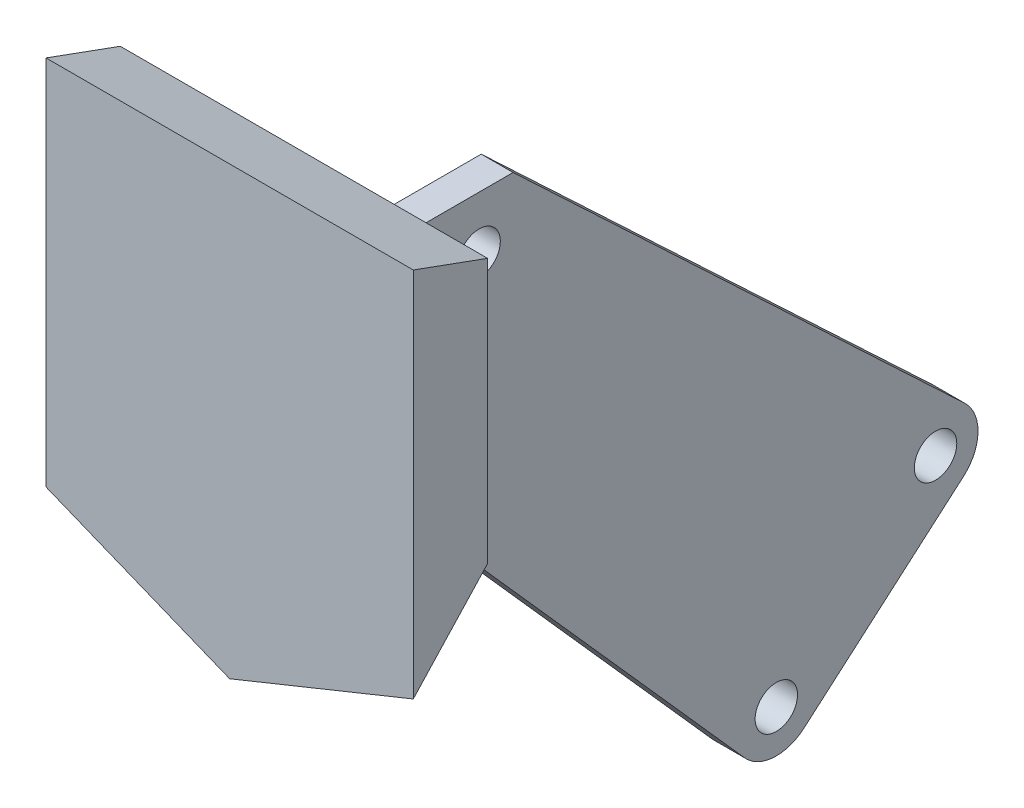
ISO-10303-21;
HEADER;
FILE_DESCRIPTION(('STEP AP214'),'2;1');
FILE_NAME('part.step','',(''),(''),'','','');
FILE_SCHEMA(('AUTOMOTIVE_DESIGN { 1 0 10303 214 1 1 1 1 }'));
ENDSEC;
DATA;
#1=APPLICATION_CONTEXT('core data for automotive mechanical design processes');
#2=APPLICATION_PROTOCOL_DEFINITION('international standard','automotive_design',2000,#1);
#3=PRODUCT_CONTEXT('',#1,'mechanical');
#4=PRODUCT('Part','Part','',(#3));
#5=PRODUCT_RELATED_PRODUCT_CATEGORY('part','',(#4));
#6=PRODUCT_DEFINITION_FORMATION('','',#4);
#7=PRODUCT_DEFINITION_CONTEXT('part definition',#1,'design');
#8=PRODUCT_DEFINITION('design','',#6,#7);
#9=PRODUCT_DEFINITION_SHAPE('','',#8);
#10=(LENGTH_UNIT() NAMED_UNIT(*) SI_UNIT(.MILLI.,.METRE.));
#11=(NAMED_UNIT(*) PLANE_ANGLE_UNIT() SI_UNIT($,.RADIAN.));
#12=(NAMED_UNIT(*) SI_UNIT($,.STERADIAN.) SOLID_ANGLE_UNIT());
#13=UNCERTAINTY_MEASURE_WITH_UNIT(LENGTH_MEASURE(1.E-05),#10,'distance_accuracy_value','');
#14=(GEOMETRIC_REPRESENTATION_CONTEXT(3) GLOBAL_UNCERTAINTY_ASSIGNED_CONTEXT((#13)) GLOBAL_UNIT_ASSIGNED_CONTEXT((#10,
#11,#12)) REPRESENTATION_CONTEXT('',''));
#15=CARTESIAN_POINT('',(0.,0.,0.));
#16=DIRECTION('',(0.,0.,1.));
#17=DIRECTION('',(1.,0.,0.));
#18=AXIS2_PLACEMENT_3D('',#15,#16,#17);
#19=CARTESIAN_POINT('',(0.,0.,-7.));
#20=DIRECTION('',(0.,0.,1.));
#21=DIRECTION('',(1.,0.,0.));
#22=AXIS2_PLACEMENT_3D('',#19,#20,#21);
#23=PLANE('',#22);
#24=DIRECTION('',(0.,-1.,0.));
#25=VECTOR('',#24,1.);
#26=CARTESIAN_POINT('',(8.5,14.9522083601366,-7.));
#27=LINE('',#26,#25);
#28=CARTESIAN_POINT('',(8.5,14.9522083601366,-7.));
#29=VERTEX_POINT('',#28);
#30=CARTESIAN_POINT('',(8.5,0.,-7.));
#31=VERTEX_POINT('',#30);
#32=EDGE_CURVE('E183',#29,#31,#27,.T.);
#33=ORIENTED_EDGE('',*,*,#32,.T.);
#34=DIRECTION('',(1.,0.,0.));
#35=VECTOR('',#34,1.);
#36=CARTESIAN_POINT('',(8.5,0.,-7.));
#37=LINE('',#36,#35);
#38=CARTESIAN_POINT('',(-17.3,0.,-7.));
#39=VERTEX_POINT('',#38);
#40=EDGE_CURVE('E221',#39,#31,#37,.T.);
#41=ORIENTED_EDGE('',*,*,#40,.F.);
#42=DIRECTION('',(0.,-1.,0.));
#43=VECTOR('',#42,1.);
#44=CARTESIAN_POINT('',(-17.3,-17.5,-7.));
#45=LINE('',#44,#43);
#46=CARTESIAN_POINT('',(-17.3,14.9522083601366,-7.));
#47=VERTEX_POINT('',#46);
#48=EDGE_CURVE('E268',#47,#39,#45,.T.);
#49=ORIENTED_EDGE('',*,*,#48,.F.);
#50=DIRECTION('',(1.,0.,0.));
#51=VECTOR('',#50,1.);
#52=CARTESIAN_POINT('',(17.3,14.9522083601366,-7.));
#53=LINE('',#52,#51);
#54=EDGE_CURVE('E298',#47,#29,#53,.T.);
#55=ORIENTED_EDGE('',*,*,#54,.T.);
#56=EDGE_LOOP('',(#33,#41,#49,#55));
#57=FACE_BOUND('',#56,.T.);
#58=ADVANCED_FACE('F33',(#57),#23,.F.);
#59=CARTESIAN_POINT('',(8.5,-12.,-15.2));
#60=DIRECTION('',(1.,0.,0.));
#61=DIRECTION('',(0.,0.,-1.));
#62=AXIS2_PLACEMENT_3D('',#59,#60,#61);
#63=PLANE('',#62);
#64=DIRECTION('',(0.,0.,-1.));
#65=VECTOR('',#64,1.);
#66=CARTESIAN_POINT('',(8.5,-12.,-15.2));
#67=LINE('',#66,#65);
#68=CARTESIAN_POINT('',(8.5,-12.,-7.));
#69=VERTEX_POINT('',#68);
#70=CARTESIAN_POINT('',(8.5,-12.,-8.82366423719207));
#71=VERTEX_POINT('',#70);
#72=EDGE_CURVE('E225',#69,#71,#67,.T.);
#73=ORIENTED_EDGE('',*,*,#72,.T.);
#74=DIRECTION('',(0.,-0.747359492890157,-0.664419888614849));
#75=VECTOR('',#74,1.);
#76=CARTESIAN_POINT('',(8.5,-43.7054711943228,-37.0105620284394));
#77=LINE('',#76,#75);
#78=CARTESIAN_POINT('',(8.5,-9.94868756510111,-7.));
#79=VERTEX_POINT('',#78);
#80=EDGE_CURVE('E353',#79,#71,#77,.T.);
#81=ORIENTED_EDGE('',*,*,#80,.F.);
#82=DIRECTION('',(0.,1.,0.));
#83=VECTOR('',#82,1.);
#84=CARTESIAN_POINT('',(8.5,-12.,-7.));
#85=LINE('',#84,#83);
#86=EDGE_CURVE('E238',#69,#79,#85,.T.);
#87=ORIENTED_EDGE('',*,*,#86,.F.);
#88=EDGE_LOOP('',(#73,#81,#87));
#89=FACE_BOUND('',#88,.T.);
#90=ADVANCED_FACE('F352',(#89),#63,.T.);
#91=DIRECTION('',(-1.,0.,0.));
#92=VECTOR('',#91,1.);
#93=CARTESIAN_POINT('',(11.5,-9.94868756510111,-7.));
#94=LINE('',#93,#92);
#95=CARTESIAN_POINT('',(11.5,-9.94868756510111,-7.));
#96=VERTEX_POINT('',#95);
#97=EDGE_CURVE('E370',#96,#79,#94,.T.);
#98=ORIENTED_EDGE('',*,*,#97,.F.);
#99=DIRECTION('',(0.,-1.,0.));
#100=VECTOR('',#99,1.);
#101=CARTESIAN_POINT('',(11.5,14.9522083601366,-7.));
#102=LINE('',#101,#100);
#103=CARTESIAN_POINT('',(11.5,14.9522083601366,-7.));
#104=VERTEX_POINT('',#103);
#105=EDGE_CURVE('E180',#104,#96,#102,.T.);
#106=ORIENTED_EDGE('',*,*,#105,.F.);
#107=CARTESIAN_POINT('',(17.3,14.9522083601366,-7.));
#108=VERTEX_POINT('',#107);
#109=EDGE_CURVE('E54',#104,#108,#53,.T.);
#110=ORIENTED_EDGE('',*,*,#109,.T.);
#111=DIRECTION('',(0.,1.,0.));
#112=VECTOR('',#111,1.);
#113=CARTESIAN_POINT('',(17.3,17.5,-7.));
#114=LINE('',#113,#112);
#115=CARTESIAN_POINT('',(17.3,-9.94868756510111,-7.));
#116=VERTEX_POINT('',#115);
#117=EDGE_CURVE('E264',#116,#108,#114,.T.);
#118=ORIENTED_EDGE('',*,*,#117,.F.);
#119=DIRECTION('',(-0.926991176745522,-0.375083135099344,0.));
#120=VECTOR('',#119,1.);
#121=CARTESIAN_POINT('',(-2.62558194569542,-18.0110617627813,-7.));
#122=LINE('',#121,#120);
#123=CARTESIAN_POINT('',(0.,-16.9486875651011,-7.));
#124=VERTEX_POINT('',#123);
#125=EDGE_CURVE('E271',#116,#124,#122,.T.);
#126=ORIENTED_EDGE('',*,*,#125,.T.);
#127=DIRECTION('',(-0.926991176745522,0.375083135099344,0.));
#128=VECTOR('',#127,1.);
#129=CARTESIAN_POINT('',(-14.6744180543046,-11.0110617627813,-7.));
#130=LINE('',#129,#128);
#131=CARTESIAN_POINT('',(-12.2303278394641,-12.,-7.));
#132=VERTEX_POINT('',#131);
#133=EDGE_CURVE('E288',#124,#132,#130,.T.);
#134=ORIENTED_EDGE('',*,*,#133,.T.);
#135=DIRECTION('',(1.,0.,0.));
#136=VECTOR('',#135,1.);
#137=CARTESIAN_POINT('',(8.5,-12.,-7.));
#138=LINE('',#137,#136);
#139=EDGE_CURVE('E41',#132,#69,#138,.T.);
#140=ORIENTED_EDGE('',*,*,#139,.T.);
#141=ORIENTED_EDGE('',*,*,#86,.T.);
#142=EDGE_LOOP('',(#98,#106,#110,#118,#126,#134,#140,#141));
#143=FACE_BOUND('',#142,.T.);
#144=ADVANCED_FACE('F304',(#143),#23,.F.);
#145=CARTESIAN_POINT('',(17.3,17.5,-7.));
#146=DIRECTION('',(1.,0.,0.));
#147=DIRECTION('',(0.,0.,-1.));
#148=AXIS2_PLACEMENT_3D('',#145,#146,#147);
#149=PLANE('',#148);
#150=ORIENTED_EDGE('',*,*,#117,.T.);
#151=DIRECTION('',(0.,0.342020143325666,0.93969262078591));
#152=VECTOR('',#151,1.);
#153=CARTESIAN_POINT('',(17.3,15.2502433660971,-6.18115555091643));
#154=LINE('',#153,#152);
#155=CARTESIAN_POINT('',(17.3,17.5,0.));
#156=VERTEX_POINT('',#155);
#157=EDGE_CURVE('E300',#108,#156,#154,.T.);
#158=ORIENTED_EDGE('',*,*,#157,.T.);
#159=DIRECTION('',(0.,1.,0.));
#160=VECTOR('',#159,1.);
#161=CARTESIAN_POINT('',(17.3,17.5,0.));
#162=LINE('',#161,#160);
#163=CARTESIAN_POINT('',(17.3,-17.5,0.));
#164=VERTEX_POINT('',#163);
#165=EDGE_CURVE('E272',#164,#156,#162,.T.);
#166=ORIENTED_EDGE('',*,*,#165,.F.);
#167=DIRECTION('',(0.,0.733371095333155,-0.679828534654032));
#168=VECTOR('',#167,1.);
#169=CARTESIAN_POINT('',(17.3,4.81412690114105,-20.6849987541376));
#170=LINE('',#169,#168);
#171=EDGE_CURVE('E293',#164,#116,#170,.T.);
#172=ORIENTED_EDGE('',*,*,#171,.T.);
#173=EDGE_LOOP('',(#150,#158,#166,#172));
#174=FACE_BOUND('',#173,.T.);
#175=ADVANCED_FACE('F449',(#174),#149,.T.);
#176=CARTESIAN_POINT('',(-17.3,-17.5,-7.));
#177=DIRECTION('',(-1.,0.,0.));
#178=DIRECTION('',(0.,0.,1.));
#179=AXIS2_PLACEMENT_3D('',#176,#177,#178);
#180=PLANE('',#179);
#181=DIRECTION('',(0.,-1.,0.));
#182=VECTOR('',#181,1.);
#183=CARTESIAN_POINT('',(-17.3,-17.5,0.));
#184=LINE('',#183,#182);
#185=CARTESIAN_POINT('',(-17.3,17.5,0.));
#186=VERTEX_POINT('',#185);
#187=CARTESIAN_POINT('',(-17.3,-17.5,0.));
#188=VERTEX_POINT('',#187);
#189=EDGE_CURVE('E278',#186,#188,#184,.T.);
#190=ORIENTED_EDGE('',*,*,#189,.F.);
#191=DIRECTION('',(0.,-0.342020143325666,-0.93969262078591));
#192=VECTOR('',#191,1.);
#193=CARTESIAN_POINT('',(-17.3,11.1560211206793,-17.4299387204308));
#194=LINE('',#193,#192);
#195=EDGE_CURVE('E295',#186,#47,#194,.T.);
#196=ORIENTED_EDGE('',*,*,#195,.T.);
#197=ORIENTED_EDGE('',*,*,#48,.T.);
#198=CARTESIAN_POINT('',(-17.3,-9.9486875651011,-7.));
#199=VERTEX_POINT('',#198);
#200=EDGE_CURVE('E266',#39,#199,#45,.T.);
#201=ORIENTED_EDGE('',*,*,#200,.T.);
#202=DIRECTION('',(0.,-0.733371095333155,0.679828534654032));
#203=VECTOR('',#202,1.);
#204=CARTESIAN_POINT('',(-17.3,-14.0100338203143,-3.23516785570894));
#205=LINE('',#204,#203);
#206=EDGE_CURVE('E291',#199,#188,#205,.T.);
#207=ORIENTED_EDGE('',*,*,#206,.T.);
#208=EDGE_LOOP('',(#190,#196,#197,#201,#207));
#209=FACE_BOUND('',#208,.T.);
#210=ADVANCED_FACE('F322',(#209),#180,.T.);
#211=CARTESIAN_POINT('',(0.,0.,0.));
#212=DIRECTION('',(0.,0.,1.));
#213=DIRECTION('',(1.,0.,0.));
#214=AXIS2_PLACEMENT_3D('',#211,#212,#213);
#215=PLANE('',#214);
#216=ORIENTED_EDGE('',*,*,#165,.T.);
#217=DIRECTION('',(-1.,0.,0.));
#218=VECTOR('',#217,1.);
#219=CARTESIAN_POINT('',(-17.3,17.5,0.));
#220=LINE('',#219,#218);
#221=EDGE_CURVE('E275',#156,#186,#220,.T.);
#222=ORIENTED_EDGE('',*,*,#221,.T.);
#223=ORIENTED_EDGE('',*,*,#189,.T.);
#224=DIRECTION('',(0.926991176745522,-0.375083135099344,0.));
#225=VECTOR('',#224,1.);
#226=CARTESIAN_POINT('',(-17.3,-17.5,0.));
#227=LINE('',#226,#225);
#228=CARTESIAN_POINT('',(0.,-24.5,0.));
#229=VERTEX_POINT('',#228);
#230=EDGE_CURVE('E281',#188,#229,#227,.T.);
#231=ORIENTED_EDGE('',*,*,#230,.T.);
#232=DIRECTION('',(0.926991176745522,0.375083135099344,0.));
#233=VECTOR('',#232,1.);
#234=CARTESIAN_POINT('',(0.,-24.5,0.));
#235=LINE('',#234,#233);
#236=EDGE_CURVE('E267',#229,#164,#235,.T.);
#237=ORIENTED_EDGE('',*,*,#236,.T.);
#238=EDGE_LOOP('',(#216,#222,#223,#231,#237));
#239=FACE_BOUND('',#238,.T.);
#240=ADVANCED_FACE('F324',(#239),#215,.T.);
#241=CARTESIAN_POINT('',(0.,-24.5,0.));
#242=DIRECTION('',(0.265223828337456,-0.655481747176855,-0.707106781186549));
#243=DIRECTION('',(-0.926991176745522,-0.375083135099344,0.));
#244=AXIS2_PLACEMENT_3D('',#241,#242,#243);
#245=PLANE('',#244);
#246=ORIENTED_EDGE('',*,*,#171,.F.);
#247=ORIENTED_EDGE('',*,*,#236,.F.);
#248=DIRECTION('',(0.,0.733371095333155,-0.679828534654032));
#249=VECTOR('',#248,1.);
#250=CARTESIAN_POINT('',(0.,-24.5,0.));
#251=LINE('',#250,#249);
#252=EDGE_CURVE('E255',#124,#229,#251,.F.);
#253=ORIENTED_EDGE('',*,*,#252,.F.);
#254=ORIENTED_EDGE('',*,*,#125,.F.);
#255=EDGE_LOOP('',(#246,#247,#253,#254));
#256=FACE_BOUND('',#255,.T.);
#257=ADVANCED_FACE('F460',(#256),#245,.T.);
#258=CARTESIAN_POINT('',(-17.3,-17.5,0.));
#259=DIRECTION('',(-0.265223828337456,-0.655481747176855,-0.707106781186549));
#260=DIRECTION('',(-0.926991176745522,0.375083135099344,0.));
#261=AXIS2_PLACEMENT_3D('',#258,#259,#260);
#262=PLANE('',#261);
#263=ORIENTED_EDGE('',*,*,#206,.F.);
#264=EDGE_CURVE('E287',#132,#199,#130,.T.);
#265=ORIENTED_EDGE('',*,*,#264,.F.);
#266=ORIENTED_EDGE('',*,*,#133,.F.);
#267=ORIENTED_EDGE('',*,*,#252,.T.);
#268=ORIENTED_EDGE('',*,*,#230,.F.);
#269=EDGE_LOOP('',(#263,#265,#266,#267,#268));
#270=FACE_BOUND('',#269,.T.);
#271=ADVANCED_FACE('F316',(#270),#262,.T.);
#272=CARTESIAN_POINT('',(-17.3,17.5,0.));
#273=DIRECTION('',(0.,0.939692620785909,-0.342020143325666));
#274=DIRECTION('',(1.,0.,0.));
#275=AXIS2_PLACEMENT_3D('',#272,#273,#274);
#276=PLANE('',#275);
#277=ORIENTED_EDGE('',*,*,#157,.F.);
#278=ORIENTED_EDGE('',*,*,#109,.F.);
#279=DIRECTION('',(-1.,0.,0.));
#280=VECTOR('',#279,1.);
#281=CARTESIAN_POINT('',(11.5,14.9522083601366,-7.));
#282=LINE('',#281,#280);
#283=EDGE_CURVE('E372',#104,#29,#282,.T.);
#284=ORIENTED_EDGE('',*,*,#283,.T.);
#285=ORIENTED_EDGE('',*,*,#54,.F.);
#286=ORIENTED_EDGE('',*,*,#195,.F.);
#287=ORIENTED_EDGE('',*,*,#221,.F.);
#288=EDGE_LOOP('',(#277,#278,#284,#285,#286,#287));
#289=FACE_BOUND('',#288,.T.);
#290=ADVANCED_FACE('F35',(#289),#276,.T.);
#291=CARTESIAN_POINT('',(8.5,-12.,-7.));
#292=DIRECTION('',(0.,0.,1.));
#293=DIRECTION('',(1.,0.,0.));
#294=AXIS2_PLACEMENT_3D('',#291,#292,#293);
#295=PLANE('',#294);
#296=CARTESIAN_POINT('',(-17.3,-12.,-7.));
#297=VERTEX_POINT('',#296);
#298=EDGE_CURVE('E222',#297,#132,#138,.T.);
#299=ORIENTED_EDGE('',*,*,#298,.T.);
#300=ORIENTED_EDGE('',*,*,#264,.T.);
#301=DIRECTION('',(0.,1.,0.));
#302=VECTOR('',#301,1.);
#303=CARTESIAN_POINT('',(-17.3,-12.,-7.));
#304=LINE('',#303,#302);
#305=EDGE_CURVE('E252',#297,#199,#304,.T.);
#306=ORIENTED_EDGE('',*,*,#305,.F.);
#307=EDGE_LOOP('',(#299,#300,#306));
#308=FACE_BOUND('',#307,.T.);
#309=ADVANCED_FACE('F313',(#308),#295,.T.);
#310=CARTESIAN_POINT('',(-17.3,-12.,-7.));
#311=DIRECTION('',(-0.707106781186549,0.,0.707106781186546));
#312=DIRECTION('',(0.707106781186546,0.,0.707106781186549));
#313=AXIS2_PLACEMENT_3D('',#310,#311,#312);
#314=PLANE('',#313);
#315=CARTESIAN_POINT('',(-20.,-5.,-9.70000000000001));
#316=DIRECTION('',(-0.707106781186549,0.,0.707106781186546));
#317=DIRECTION('',(-0.707106781186546,0.,-0.707106781186549));
#318=AXIS2_PLACEMENT_3D('',#315,#316,#317);
#319=ELLIPSE('',#318,2.82842712474619,2.);
#320=CARTESIAN_POINT('',(-20.5,-3.06350832689629,-10.2));
#321=VERTEX_POINT('',#320);
#322=CARTESIAN_POINT('',(-20.5,-6.9364916731037,-10.2));
#323=VERTEX_POINT('',#322);
#324=EDGE_CURVE('E217',#321,#323,#319,.T.);
#325=ORIENTED_EDGE('',*,*,#324,.F.);
#326=DIRECTION('',(0.,1.,0.));
#327=VECTOR('',#326,1.);
#328=CARTESIAN_POINT('',(-20.5,-12.,-10.2));
#329=LINE('',#328,#327);
#330=EDGE_CURVE('E11',#323,#321,#329,.T.);
#331=ORIENTED_EDGE('',*,*,#330,.F.);
#332=EDGE_LOOP('',(#325,#331));
#333=FACE_BOUND('',#332,.T.);
#334=DIRECTION('',(0.707106781186546,0.,0.707106781186549));
#335=VECTOR('',#334,1.);
#336=CARTESIAN_POINT('',(-17.3,0.,-7.));
#337=LINE('',#336,#335);
#338=CARTESIAN_POINT('',(-23.5,0.,-13.2));
#339=VERTEX_POINT('',#338);
#340=EDGE_CURVE('E226',#339,#39,#337,.T.);
#341=ORIENTED_EDGE('',*,*,#340,.F.);
#342=DIRECTION('',(0.,1.,0.));
#343=VECTOR('',#342,1.);
#344=CARTESIAN_POINT('',(-23.5,-12.,-13.2));
#345=LINE('',#344,#343);
#346=CARTESIAN_POINT('',(-23.5,-12.,-13.2));
#347=VERTEX_POINT('',#346);
#348=EDGE_CURVE('E256',#347,#339,#345,.T.);
#349=ORIENTED_EDGE('',*,*,#348,.F.);
#350=DIRECTION('',(0.707106781186546,0.,0.707106781186549));
#351=VECTOR('',#350,1.);
#352=CARTESIAN_POINT('',(-17.3,-12.,-7.));
#353=LINE('',#352,#351);
#354=EDGE_CURVE('E235',#347,#297,#353,.T.);
#355=ORIENTED_EDGE('',*,*,#354,.T.);
#356=ORIENTED_EDGE('',*,*,#305,.T.);
#357=ORIENTED_EDGE('',*,*,#200,.F.);
#358=EDGE_LOOP('',(#341,#349,#355,#356,#357));
#359=FACE_BOUND('',#358,.T.);
#360=ADVANCED_FACE('F339',(#333,#359),#314,.T.);
#361=CARTESIAN_POINT('',(-23.5,-12.,-13.2));
#362=DIRECTION('',(-1.,0.,0.));
#363=DIRECTION('',(0.,0.,1.));
#364=AXIS2_PLACEMENT_3D('',#361,#362,#363);
#365=PLANE('',#364);
#366=DIRECTION('',(0.,0.,1.));
#367=VECTOR('',#366,1.);
#368=CARTESIAN_POINT('',(-23.5,0.,-13.2));
#369=LINE('',#368,#367);
#370=CARTESIAN_POINT('',(-23.5,0.,-15.2));
#371=VERTEX_POINT('',#370);
#372=EDGE_CURVE('E247',#371,#339,#369,.T.);
#373=ORIENTED_EDGE('',*,*,#372,.F.);
#374=DIRECTION('',(0.,1.,0.));
#375=VECTOR('',#374,1.);
#376=CARTESIAN_POINT('',(-23.5,-12.,-15.2));
#377=LINE('',#376,#375);
#378=CARTESIAN_POINT('',(-23.5,-12.,-15.2));
#379=VERTEX_POINT('',#378);
#380=EDGE_CURVE('E258',#379,#371,#377,.T.);
#381=ORIENTED_EDGE('',*,*,#380,.F.);
#382=DIRECTION('',(0.,0.,1.));
#383=VECTOR('',#382,1.);
#384=CARTESIAN_POINT('',(-23.5,-12.,-13.2));
#385=LINE('',#384,#383);
#386=EDGE_CURVE('E232',#379,#347,#385,.T.);
#387=ORIENTED_EDGE('',*,*,#386,.T.);
#388=ORIENTED_EDGE('',*,*,#348,.T.);
#389=EDGE_LOOP('',(#373,#381,#387,#388));
#390=FACE_BOUND('',#389,.T.);
#391=ADVANCED_FACE('F501',(#390),#365,.T.);
#392=CARTESIAN_POINT('',(-23.5,-12.,-15.2));
#393=DIRECTION('',(0.,0.,-1.));
#394=DIRECTION('',(-1.,0.,0.));
#395=AXIS2_PLACEMENT_3D('',#392,#393,#394);
#396=PLANE('',#395);
#397=CARTESIAN_POINT('',(5.,-5.,-15.2));
#398=DIRECTION('',(0.,0.,-1.));
#399=DIRECTION('',(-1.,0.,0.));
#400=AXIS2_PLACEMENT_3D('',#397,#398,#399);
#401=CIRCLE('',#400,2.);
#402=CARTESIAN_POINT('',(3.,-5.,-15.2));
#403=VERTEX_POINT('',#402);
#404=EDGE_CURVE('E208',#403,#403,#401,.T.);
#405=ORIENTED_EDGE('',*,*,#404,.F.);
#406=EDGE_LOOP('',(#405));
#407=FACE_BOUND('',#406,.T.);
#408=CARTESIAN_POINT('',(-20.,-5.,-15.2));
#409=DIRECTION('',(0.,0.,-1.));
#410=DIRECTION('',(1.,0.,0.));
#411=AXIS2_PLACEMENT_3D('',#408,#409,#410);
#412=CIRCLE('',#411,2.);
#413=CARTESIAN_POINT('',(-18.,-5.,-15.2));
#414=VERTEX_POINT('',#413);
#415=EDGE_CURVE('E201',#414,#414,#412,.T.);
#416=ORIENTED_EDGE('',*,*,#415,.F.);
#417=EDGE_LOOP('',(#416));
#418=FACE_BOUND('',#417,.T.);
#419=CARTESIAN_POINT('',(-14.5,-7.39791576165636,-15.2));
#420=DIRECTION('',(0.,0.,-1.));
#421=DIRECTION('',(1.,0.,0.));
#422=AXIS2_PLACEMENT_3D('',#419,#420,#421);
#423=CIRCLE('',#422,2.);
#424=CARTESIAN_POINT('',(-12.5,-7.39791576165636,-15.2));
#425=VERTEX_POINT('',#424);
#426=EDGE_CURVE('E192',#425,#425,#423,.T.);
#427=ORIENTED_EDGE('',*,*,#426,.F.);
#428=EDGE_LOOP('',(#427));
#429=FACE_BOUND('',#428,.T.);
#430=CARTESIAN_POINT('',(-0.5,-7.39791576165636,-15.2));
#431=DIRECTION('',(0.,0.,-1.));
#432=DIRECTION('',(-1.,0.,0.));
#433=AXIS2_PLACEMENT_3D('',#430,#431,#432);
#434=CIRCLE('',#433,2.);
#435=CARTESIAN_POINT('',(-2.5,-7.39791576165636,-15.2));
#436=VERTEX_POINT('',#435);
#437=EDGE_CURVE('E207',#436,#436,#434,.T.);
#438=ORIENTED_EDGE('',*,*,#437,.F.);
#439=EDGE_LOOP('',(#438));
#440=FACE_BOUND('',#439,.T.);
#441=DIRECTION('',(-1.,0.,0.));
#442=VECTOR('',#441,1.);
#443=CARTESIAN_POINT('',(-23.5,0.,-15.2));
#444=LINE('',#443,#442);
#445=CARTESIAN_POINT('',(8.5,0.,-15.2));
#446=VERTEX_POINT('',#445);
#447=EDGE_CURVE('E244',#446,#371,#444,.T.);
#448=ORIENTED_EDGE('',*,*,#447,.F.);
#449=DIRECTION('',(0.,1.,0.));
#450=VECTOR('',#449,1.);
#451=CARTESIAN_POINT('',(8.5,-12.,-15.2));
#452=LINE('',#451,#450);
#453=CARTESIAN_POINT('',(8.5,-12.,-15.2));
#454=VERTEX_POINT('',#453);
#455=EDGE_CURVE('E260',#454,#446,#452,.T.);
#456=ORIENTED_EDGE('',*,*,#455,.F.);
#457=DIRECTION('',(-1.,0.,0.));
#458=VECTOR('',#457,1.);
#459=CARTESIAN_POINT('',(-23.5,-12.,-15.2));
#460=LINE('',#459,#458);
#461=EDGE_CURVE('E229',#454,#379,#460,.T.);
#462=ORIENTED_EDGE('',*,*,#461,.T.);
#463=ORIENTED_EDGE('',*,*,#380,.T.);
#464=EDGE_LOOP('',(#448,#456,#462,#463));
#465=FACE_BOUND('',#464,.T.);
#466=ADVANCED_FACE('F346',(#407,#418,#429,#440,#465),#396,.T.);
#467=CARTESIAN_POINT('',(0.,-12.,0.));
#468=DIRECTION('',(0.,-1.,0.));
#469=DIRECTION('',(0.,0.,-1.));
#470=AXIS2_PLACEMENT_3D('',#467,#468,#469);
#471=PLANE('',#470);
#472=ORIENTED_EDGE('',*,*,#298,.F.);
#473=ORIENTED_EDGE('',*,*,#354,.F.);
#474=ORIENTED_EDGE('',*,*,#386,.F.);
#475=ORIENTED_EDGE('',*,*,#461,.F.);
#476=DIRECTION('',(0.,0.,1.));
#477=VECTOR('',#476,1.);
#478=CARTESIAN_POINT('',(8.5,-12.,0.));
#479=LINE('',#478,#477);
#480=EDGE_CURVE('E189',#454,#71,#479,.T.);
#481=ORIENTED_EDGE('',*,*,#480,.T.);
#482=ORIENTED_EDGE('',*,*,#72,.F.);
#483=ORIENTED_EDGE('',*,*,#139,.F.);
#484=EDGE_LOOP('',(#472,#473,#474,#475,#481,#482,#483));
#485=FACE_BOUND('',#484,.T.);
#486=ADVANCED_FACE('F309',(#485),#471,.T.);
#487=CARTESIAN_POINT('',(0.,0.,0.));
#488=DIRECTION('',(0.,-1.,0.));
#489=DIRECTION('',(0.,0.,-1.));
#490=AXIS2_PLACEMENT_3D('',#487,#488,#489);
#491=PLANE('',#490);
#492=ORIENTED_EDGE('',*,*,#40,.T.);
#493=DIRECTION('',(0.,0.,-1.));
#494=VECTOR('',#493,1.);
#495=CARTESIAN_POINT('',(8.5,0.,-15.2));
#496=LINE('',#495,#494);
#497=EDGE_CURVE('E241',#31,#446,#496,.T.);
#498=ORIENTED_EDGE('',*,*,#497,.T.);
#499=ORIENTED_EDGE('',*,*,#447,.T.);
#500=ORIENTED_EDGE('',*,*,#372,.T.);
#501=ORIENTED_EDGE('',*,*,#340,.T.);
#502=EDGE_LOOP('',(#492,#498,#499,#500,#501));
#503=FACE_BOUND('',#502,.T.);
#504=ADVANCED_FACE('F335',(#503),#491,.F.);
#505=CARTESIAN_POINT('',(-0.5,-7.39791576165636,-10.2));
#506=DIRECTION('',(0.,0.,-1.));
#507=DIRECTION('',(-1.,0.,0.));
#508=AXIS2_PLACEMENT_3D('',#505,#506,#507);
#509=CYLINDRICAL_SURFACE('',#508,2.);
#510=CARTESIAN_POINT('',(-0.5,-7.39791576165636,-10.2));
#511=DIRECTION('',(0.,0.,-1.));
#512=DIRECTION('',(-1.,0.,0.));
#513=AXIS2_PLACEMENT_3D('',#510,#511,#512);
#514=CIRCLE('',#513,2.);
#515=CARTESIAN_POINT('',(-2.5,-7.39791576165636,-10.2));
#516=VERTEX_POINT('',#515);
#517=EDGE_CURVE('E214',#516,#516,#514,.T.);
#518=ORIENTED_EDGE('',*,*,#517,.F.);
#519=EDGE_LOOP('',(#518));
#520=FACE_BOUND('',#519,.T.);
#521=ORIENTED_EDGE('',*,*,#437,.T.);
#522=EDGE_LOOP('',(#521));
#523=FACE_BOUND('',#522,.T.);
#524=ADVANCED_FACE('F519',(#520,#523),#509,.F.);
#525=CARTESIAN_POINT('',(-0.5,-7.39791576165636,-10.2));
#526=DIRECTION('',(0.,0.,-1.));
#527=DIRECTION('',(-1.,0.,0.));
#528=AXIS2_PLACEMENT_3D('',#525,#526,#527);
#529=PLANE('',#528);
#530=ORIENTED_EDGE('',*,*,#517,.T.);
#531=EDGE_LOOP('',(#530));
#532=FACE_BOUND('',#531,.T.);
#533=ADVANCED_FACE('F524',(#532),#529,.T.);
#534=CARTESIAN_POINT('',(-14.5,-7.39791576165636,-10.2));
#535=DIRECTION('',(0.,0.,-1.));
#536=DIRECTION('',(-1.,0.,0.));
#537=AXIS2_PLACEMENT_3D('',#534,#535,#536);
#538=CYLINDRICAL_SURFACE('',#537,2.);
#539=CARTESIAN_POINT('',(-14.5,-7.39791576165636,-10.2));
#540=DIRECTION('',(0.,0.,-1.));
#541=DIRECTION('',(1.,0.,0.));
#542=AXIS2_PLACEMENT_3D('',#539,#540,#541);
#543=CIRCLE('',#542,2.);
#544=CARTESIAN_POINT('',(-12.5,-7.39791576165636,-10.2));
#545=VERTEX_POINT('',#544);
#546=EDGE_CURVE('E198',#545,#545,#543,.T.);
#547=ORIENTED_EDGE('',*,*,#546,.F.);
#548=EDGE_LOOP('',(#547));
#549=FACE_BOUND('',#548,.T.);
#550=ORIENTED_EDGE('',*,*,#426,.T.);
#551=EDGE_LOOP('',(#550));
#552=FACE_BOUND('',#551,.T.);
#553=ADVANCED_FACE('F536',(#549,#552),#538,.F.);
#554=CARTESIAN_POINT('',(-14.5,-7.39791576165636,-10.2));
#555=DIRECTION('',(0.,0.,1.));
#556=DIRECTION('',(1.,0.,0.));
#557=AXIS2_PLACEMENT_3D('',#554,#555,#556);
#558=PLANE('',#557);
#559=ORIENTED_EDGE('',*,*,#546,.T.);
#560=EDGE_LOOP('',(#559));
#561=FACE_BOUND('',#560,.T.);
#562=ADVANCED_FACE('F546',(#561),#558,.F.);
#563=CARTESIAN_POINT('',(-20.,-5.,-10.2));
#564=DIRECTION('',(0.,0.,-1.));
#565=DIRECTION('',(-1.,0.,0.));
#566=AXIS2_PLACEMENT_3D('',#563,#564,#565);
#567=CYLINDRICAL_SURFACE('',#566,2.);
#568=ORIENTED_EDGE('',*,*,#324,.T.);
#569=CARTESIAN_POINT('',(-20.,-5.,-10.2));
#570=DIRECTION('',(0.,0.,-1.));
#571=DIRECTION('',(1.,0.,0.));
#572=AXIS2_PLACEMENT_3D('',#569,#570,#571);
#573=CIRCLE('',#572,2.);
#574=EDGE_CURVE('E46',#321,#323,#573,.T.);
#575=ORIENTED_EDGE('',*,*,#574,.F.);
#576=EDGE_LOOP('',(#568,#575));
#577=FACE_BOUND('',#576,.T.);
#578=ORIENTED_EDGE('',*,*,#415,.T.);
#579=EDGE_LOOP('',(#578));
#580=FACE_BOUND('',#579,.T.);
#581=ADVANCED_FACE('F556',(#577,#580),#567,.F.);
#582=CARTESIAN_POINT('',(-20.,-5.,-10.2));
#583=DIRECTION('',(0.,0.,1.));
#584=DIRECTION('',(1.,0.,0.));
#585=AXIS2_PLACEMENT_3D('',#582,#583,#584);
#586=PLANE('',#585);
#587=ORIENTED_EDGE('',*,*,#330,.T.);
#588=ORIENTED_EDGE('',*,*,#574,.T.);
#589=EDGE_LOOP('',(#587,#588));
#590=FACE_BOUND('',#589,.T.);
#591=ADVANCED_FACE('F566',(#590),#586,.F.);
#592=CARTESIAN_POINT('',(5.,-5.,-10.2));
#593=DIRECTION('',(0.,0.,-1.));
#594=DIRECTION('',(-1.,0.,0.));
#595=AXIS2_PLACEMENT_3D('',#592,#593,#594);
#596=CYLINDRICAL_SURFACE('',#595,2.);
#597=CARTESIAN_POINT('',(5.,-5.,-10.2));
#598=DIRECTION('',(0.,0.,-1.));
#599=DIRECTION('',(-1.,0.,0.));
#600=AXIS2_PLACEMENT_3D('',#597,#598,#599);
#601=CIRCLE('',#600,2.);
#602=CARTESIAN_POINT('',(3.,-5.,-10.2));
#603=VERTEX_POINT('',#602);
#604=EDGE_CURVE('E204',#603,#603,#601,.T.);
#605=ORIENTED_EDGE('',*,*,#604,.F.);
#606=EDGE_LOOP('',(#605));
#607=FACE_BOUND('',#606,.T.);
#608=ORIENTED_EDGE('',*,*,#404,.T.);
#609=EDGE_LOOP('',(#608));
#610=FACE_BOUND('',#609,.T.);
#611=ADVANCED_FACE('F435',(#607,#610),#596,.F.);
#612=CARTESIAN_POINT('',(5.,-5.,-10.2));
#613=DIRECTION('',(0.,0.,-1.));
#614=DIRECTION('',(-1.,0.,0.));
#615=AXIS2_PLACEMENT_3D('',#612,#613,#614);
#616=PLANE('',#615);
#617=ORIENTED_EDGE('',*,*,#604,.T.);
#618=EDGE_LOOP('',(#617));
#619=FACE_BOUND('',#618,.T.);
#620=ADVANCED_FACE('F427',(#619),#616,.T.);
#621=CARTESIAN_POINT('',(11.5,-28.0477916398634,-55.));
#622=DIRECTION('',(1.,0.,0.));
#623=DIRECTION('',(0.,0.,-1.));
#624=AXIS2_PLACEMENT_3D('',#621,#622,#623);
#625=PLANE('',#624);
#626=CARTESIAN_POINT('',(11.5,-28.0477916398634,-55.));
#627=DIRECTION('',(1.,0.,0.));
#628=DIRECTION('',(0.,0.,-1.));
#629=AXIS2_PLACEMENT_3D('',#626,#627,#628);
#630=CIRCLE('',#629,2.);
#631=CARTESIAN_POINT('',(11.5,-28.0477916398634,-57.));
#632=VERTEX_POINT('',#631);
#633=EDGE_CURVE('E408',#632,#632,#630,.T.);
#634=ORIENTED_EDGE('',*,*,#633,.F.);
#635=EDGE_LOOP('',(#634));
#636=FACE_BOUND('',#635,.T.);
#637=DIRECTION('',(0.,-0.747359492890157,-0.664419888614849));
#638=VECTOR('',#637,1.);
#639=CARTESIAN_POINT('',(11.5,-43.7054711943228,-37.0105620284394));
#640=LINE('',#639,#638);
#641=CARTESIAN_POINT('',(11.5,-43.7054711943228,-37.0105620284394));
#642=VERTEX_POINT('',#641);
#643=EDGE_CURVE('E175',#96,#642,#640,.T.);
#644=ORIENTED_EDGE('',*,*,#643,.T.);
#645=CARTESIAN_POINT('',(11.5,-41.0477916398634,-40.));
#646=DIRECTION('',(1.,0.,0.));
#647=DIRECTION('',(0.,0.,1.));
#648=AXIS2_PLACEMENT_3D('',#645,#646,#647);
#649=CIRCLE('',#648,4.);
#650=CARTESIAN_POINT('',(11.5,-44.0705479710227,-42.6197221536713));
#651=VERTEX_POINT('',#650);
#652=EDGE_CURVE('E165',#642,#651,#649,.T.);
#653=ORIENTED_EDGE('',*,*,#652,.T.);
#654=DIRECTION('',(0.,0.654930538417843,-0.755689082789817));
#655=VECTOR('',#654,1.);
#656=CARTESIAN_POINT('',(11.5,-31.0705479710227,-57.6197221536713));
#657=LINE('',#656,#655);
#658=CARTESIAN_POINT('',(11.5,-31.0705479710227,-57.6197221536714));
#659=VERTEX_POINT('',#658);
#660=EDGE_CURVE('E174',#651,#659,#657,.T.);
#661=ORIENTED_EDGE('',*,*,#660,.T.);
#662=CARTESIAN_POINT('',(11.5,-28.0477916398634,-55.));
#663=DIRECTION('',(1.,0.,0.));
#664=DIRECTION('',(0.,0.,-1.));
#665=AXIS2_PLACEMENT_3D('',#662,#663,#664);
#666=CIRCLE('',#665,3.99999999999998);
#667=CARTESIAN_POINT('',(11.5,-25.1366376371623,-57.7432065858329));
#668=VERTEX_POINT('',#667);
#669=EDGE_CURVE('E386',#659,#668,#666,.T.);
#670=ORIENTED_EDGE('',*,*,#669,.T.);
#671=DIRECTION('',(0.,0.685801646458227,0.727788500675289));
#672=VECTOR('',#671,1.);
#673=CARTESIAN_POINT('',(11.5,-25.1366376371623,-57.7432065858329));
#674=LINE('',#673,#672);
#675=CARTESIAN_POINT('',(11.5,14.9522083601366,-15.2));
#676=VERTEX_POINT('',#675);
#677=EDGE_CURVE('E400',#668,#676,#674,.T.);
#678=ORIENTED_EDGE('',*,*,#677,.T.);
#679=DIRECTION('',(0.,0.,1.));
#680=VECTOR('',#679,1.);
#681=CARTESIAN_POINT('',(11.5,14.9522083601366,-15.2));
#682=LINE('',#681,#680);
#683=EDGE_CURVE('E399',#676,#104,#682,.T.);
#684=ORIENTED_EDGE('',*,*,#683,.T.);
#685=ORIENTED_EDGE('',*,*,#105,.T.);
#686=EDGE_LOOP('',(#644,#653,#661,#670,#678,#684,#685));
#687=FACE_BOUND('',#686,.T.);
#688=CARTESIAN_POINT('',(11.5,9.95220836013658,-12.));
#689=DIRECTION('',(1.,0.,0.));
#690=DIRECTION('',(0.,0.,-1.));
#691=AXIS2_PLACEMENT_3D('',#688,#689,#690);
#692=CIRCLE('',#691,2.);
#693=CARTESIAN_POINT('',(11.5,9.95220836013658,-14.));
#694=VERTEX_POINT('',#693);
#695=EDGE_CURVE('E358',#694,#694,#692,.T.);
#696=ORIENTED_EDGE('',*,*,#695,.F.);
#697=EDGE_LOOP('',(#696));
#698=FACE_BOUND('',#697,.T.);
#699=CARTESIAN_POINT('',(11.5,-41.0477916398634,-40.));
#700=DIRECTION('',(1.,0.,0.));
#701=DIRECTION('',(0.,0.,-1.));
#702=AXIS2_PLACEMENT_3D('',#699,#700,#701);
#703=CIRCLE('',#702,2.);
#704=CARTESIAN_POINT('',(11.5,-41.0477916398634,-42.));
#705=VERTEX_POINT('',#704);
#706=EDGE_CURVE('E414',#705,#705,#703,.T.);
#707=ORIENTED_EDGE('',*,*,#706,.F.);
#708=EDGE_LOOP('',(#707));
#709=FACE_BOUND('',#708,.T.);
#710=ADVANCED_FACE('F178',(#636,#687,#698,#709),#625,.T.);
#711=CARTESIAN_POINT('',(8.5,-28.0477916398634,-55.));
#712=DIRECTION('',(1.,0.,0.));
#713=DIRECTION('',(0.,0.,-1.));
#714=AXIS2_PLACEMENT_3D('',#711,#712,#713);
#715=PLANE('',#714);
#716=ORIENTED_EDGE('',*,*,#480,.F.);
#717=ORIENTED_EDGE('',*,*,#455,.T.);
#718=ORIENTED_EDGE('',*,*,#497,.F.);
#719=ORIENTED_EDGE('',*,*,#32,.F.);
#720=DIRECTION('',(0.,0.,1.));
#721=VECTOR('',#720,1.);
#722=CARTESIAN_POINT('',(8.5,14.9522083601366,-15.2));
#723=LINE('',#722,#721);
#724=CARTESIAN_POINT('',(8.5,14.9522083601366,-15.2));
#725=VERTEX_POINT('',#724);
#726=EDGE_CURVE('E367',#725,#29,#723,.T.);
#727=ORIENTED_EDGE('',*,*,#726,.F.);
#728=DIRECTION('',(0.,0.685801646458227,0.727788500675289));
#729=VECTOR('',#728,1.);
#730=CARTESIAN_POINT('',(8.5,-25.1366376371623,-57.7432065858329));
#731=LINE('',#730,#729);
#732=CARTESIAN_POINT('',(8.5,-25.1366376371623,-57.7432065858329));
#733=VERTEX_POINT('',#732);
#734=EDGE_CURVE('E365',#733,#725,#731,.T.);
#735=ORIENTED_EDGE('',*,*,#734,.F.);
#736=CARTESIAN_POINT('',(8.5,-28.0477916398634,-55.));
#737=DIRECTION('',(1.,0.,0.));
#738=DIRECTION('',(0.,0.,-1.));
#739=AXIS2_PLACEMENT_3D('',#736,#737,#738);
#740=CIRCLE('',#739,3.99999999999998);
#741=CARTESIAN_POINT('',(8.5,-31.0705479710227,-57.6197221536714));
#742=VERTEX_POINT('',#741);
#743=EDGE_CURVE('E363',#742,#733,#740,.T.);
#744=ORIENTED_EDGE('',*,*,#743,.F.);
#745=DIRECTION('',(0.,0.654930538417843,-0.755689082789817));
#746=VECTOR('',#745,1.);
#747=CARTESIAN_POINT('',(8.5,-31.0705479710227,-57.6197221536713));
#748=LINE('',#747,#746);
#749=CARTESIAN_POINT('',(8.5,-44.0705479710227,-42.6197221536713));
#750=VERTEX_POINT('',#749);
#751=EDGE_CURVE('E356',#750,#742,#748,.T.);
#752=ORIENTED_EDGE('',*,*,#751,.F.);
#753=CARTESIAN_POINT('',(8.5,-41.0477916398634,-40.));
#754=DIRECTION('',(1.,0.,0.));
#755=DIRECTION('',(0.,0.,1.));
#756=AXIS2_PLACEMENT_3D('',#753,#754,#755);
#757=CIRCLE('',#756,4.);
#758=CARTESIAN_POINT('',(8.5,-43.7054711943228,-37.0105620284394));
#759=VERTEX_POINT('',#758);
#760=EDGE_CURVE('E354',#759,#750,#757,.T.);
#761=ORIENTED_EDGE('',*,*,#760,.F.);
#762=EDGE_CURVE('E187',#71,#759,#77,.T.);
#763=ORIENTED_EDGE('',*,*,#762,.F.);
#764=EDGE_LOOP('',(#716,#717,#718,#719,#727,#735,#744,#752,#761,#763));
#765=FACE_BOUND('',#764,.T.);
#766=CARTESIAN_POINT('',(8.5,9.95220836013658,-12.));
#767=DIRECTION('',(1.,0.,0.));
#768=DIRECTION('',(0.,0.,-1.));
#769=AXIS2_PLACEMENT_3D('',#766,#767,#768);
#770=CIRCLE('',#769,2.);
#771=CARTESIAN_POINT('',(8.5,9.95220836013658,-14.));
#772=VERTEX_POINT('',#771);
#773=EDGE_CURVE('E405',#772,#772,#770,.T.);
#774=ORIENTED_EDGE('',*,*,#773,.T.);
#775=EDGE_LOOP('',(#774));
#776=FACE_BOUND('',#775,.T.);
#777=CARTESIAN_POINT('',(8.5,-28.0477916398634,-55.));
#778=DIRECTION('',(1.,0.,0.));
#779=DIRECTION('',(0.,0.,-1.));
#780=AXIS2_PLACEMENT_3D('',#777,#778,#779);
#781=CIRCLE('',#780,2.);
#782=CARTESIAN_POINT('',(8.5,-28.0477916398634,-57.));
#783=VERTEX_POINT('',#782);
#784=EDGE_CURVE('E411',#783,#783,#781,.T.);
#785=ORIENTED_EDGE('',*,*,#784,.T.);
#786=EDGE_LOOP('',(#785));
#787=FACE_BOUND('',#786,.T.);
#788=CARTESIAN_POINT('',(8.5,-41.0477916398634,-40.));
#789=DIRECTION('',(1.,0.,0.));
#790=DIRECTION('',(0.,0.,-1.));
#791=AXIS2_PLACEMENT_3D('',#788,#789,#790);
#792=CIRCLE('',#791,2.);
#793=CARTESIAN_POINT('',(8.5,-41.0477916398634,-42.));
#794=VERTEX_POINT('',#793);
#795=EDGE_CURVE('E417',#794,#794,#792,.T.);
#796=ORIENTED_EDGE('',*,*,#795,.T.);
#797=EDGE_LOOP('',(#796));
#798=FACE_BOUND('',#797,.T.);
#799=ADVANCED_FACE('F348',(#765,#776,#787,#798),#715,.F.);
#800=CARTESIAN_POINT('',(11.5,-43.7054711943228,-37.0105620284394));
#801=DIRECTION('',(0.,0.664419888614848,-0.747359492890157));
#802=DIRECTION('',(0.,0.747359492890157,0.664419888614849));
#803=AXIS2_PLACEMENT_3D('',#800,#801,#802);
#804=PLANE('',#803);
#805=ORIENTED_EDGE('',*,*,#80,.T.);
#806=ORIENTED_EDGE('',*,*,#762,.T.);
#807=DIRECTION('',(-1.,0.,0.));
#808=VECTOR('',#807,1.);
#809=CARTESIAN_POINT('',(11.5,-43.7054711943228,-37.0105620284394));
#810=LINE('',#809,#808);
#811=EDGE_CURVE('E169',#642,#759,#810,.T.);
#812=ORIENTED_EDGE('',*,*,#811,.F.);
#813=ORIENTED_EDGE('',*,*,#643,.F.);
#814=ORIENTED_EDGE('',*,*,#97,.T.);
#815=EDGE_LOOP('',(#805,#806,#812,#813,#814));
#816=FACE_BOUND('',#815,.T.);
#817=ADVANCED_FACE('F186',(#816),#804,.F.);
#818=CARTESIAN_POINT('',(11.5,-41.0477916398634,-40.));
#819=DIRECTION('',(-1.,0.,0.));
#820=DIRECTION('',(0.,0.,1.));
#821=AXIS2_PLACEMENT_3D('',#818,#819,#820);
#822=CYLINDRICAL_SURFACE('',#821,4.);
#823=ORIENTED_EDGE('',*,*,#760,.T.);
#824=DIRECTION('',(-1.,0.,0.));
#825=VECTOR('',#824,1.);
#826=CARTESIAN_POINT('',(11.5,-44.0705479710227,-42.6197221536713));
#827=LINE('',#826,#825);
#828=EDGE_CURVE('E171',#651,#750,#827,.T.);
#829=ORIENTED_EDGE('',*,*,#828,.F.);
#830=ORIENTED_EDGE('',*,*,#652,.F.);
#831=ORIENTED_EDGE('',*,*,#811,.T.);
#832=EDGE_LOOP('',(#823,#829,#830,#831));
#833=FACE_BOUND('',#832,.T.);
#834=ADVANCED_FACE('F167',(#833),#822,.T.);
#835=CARTESIAN_POINT('',(11.5,-31.0705479710227,-57.6197221536713));
#836=DIRECTION('',(0.,0.755689082789817,0.654930538417842));
#837=DIRECTION('',(0.,-0.654930538417843,0.755689082789817));
#838=AXIS2_PLACEMENT_3D('',#835,#836,#837);
#839=PLANE('',#838);
#840=ORIENTED_EDGE('',*,*,#751,.T.);
#841=DIRECTION('',(-1.,0.,0.));
#842=VECTOR('',#841,1.);
#843=CARTESIAN_POINT('',(11.5,-31.0705479710227,-57.6197221536714));
#844=LINE('',#843,#842);
#845=EDGE_CURVE('E194',#659,#742,#844,.T.);
#846=ORIENTED_EDGE('',*,*,#845,.F.);
#847=ORIENTED_EDGE('',*,*,#660,.F.);
#848=ORIENTED_EDGE('',*,*,#828,.T.);
#849=EDGE_LOOP('',(#840,#846,#847,#848));
#850=FACE_BOUND('',#849,.T.);
#851=ADVANCED_FACE('F658',(#850),#839,.F.);
#852=CARTESIAN_POINT('',(11.5,-28.0477916398634,-55.));
#853=DIRECTION('',(-1.,0.,0.));
#854=DIRECTION('',(0.,0.,1.));
#855=AXIS2_PLACEMENT_3D('',#852,#853,#854);
#856=CYLINDRICAL_SURFACE('',#855,3.99999999999998);
#857=ORIENTED_EDGE('',*,*,#743,.T.);
#858=DIRECTION('',(-1.,0.,0.));
#859=VECTOR('',#858,1.);
#860=CARTESIAN_POINT('',(11.5,-25.1366376371623,-57.7432065858329));
#861=LINE('',#860,#859);
#862=EDGE_CURVE('E377',#668,#733,#861,.T.);
#863=ORIENTED_EDGE('',*,*,#862,.F.);
#864=ORIENTED_EDGE('',*,*,#669,.F.);
#865=ORIENTED_EDGE('',*,*,#845,.T.);
#866=EDGE_LOOP('',(#857,#863,#864,#865));
#867=FACE_BOUND('',#866,.T.);
#868=ADVANCED_FACE('F384',(#867),#856,.T.);
#869=CARTESIAN_POINT('',(11.5,-25.1366376371623,-57.7432065858329));
#870=DIRECTION('',(0.,-0.727788500675289,0.685801646458227));
#871=DIRECTION('',(0.,-0.685801646458227,-0.727788500675289));
#872=AXIS2_PLACEMENT_3D('',#869,#870,#871);
#873=PLANE('',#872);
#874=ORIENTED_EDGE('',*,*,#734,.T.);
#875=DIRECTION('',(-1.,0.,0.));
#876=VECTOR('',#875,1.);
#877=CARTESIAN_POINT('',(11.5,14.9522083601366,-15.2));
#878=LINE('',#877,#876);
#879=EDGE_CURVE('E374',#676,#725,#878,.T.);
#880=ORIENTED_EDGE('',*,*,#879,.F.);
#881=ORIENTED_EDGE('',*,*,#677,.F.);
#882=ORIENTED_EDGE('',*,*,#862,.T.);
#883=EDGE_LOOP('',(#874,#880,#881,#882));
#884=FACE_BOUND('',#883,.T.);
#885=ADVANCED_FACE('F393',(#884),#873,.F.);
#886=CARTESIAN_POINT('',(11.5,14.9522083601366,-15.2));
#887=DIRECTION('',(0.,-1.,0.));
#888=DIRECTION('',(0.,0.,-1.));
#889=AXIS2_PLACEMENT_3D('',#886,#887,#888);
#890=PLANE('',#889);
#891=ORIENTED_EDGE('',*,*,#726,.T.);
#892=ORIENTED_EDGE('',*,*,#283,.F.);
#893=ORIENTED_EDGE('',*,*,#683,.F.);
#894=ORIENTED_EDGE('',*,*,#879,.T.);
#895=EDGE_LOOP('',(#891,#892,#893,#894));
#896=FACE_BOUND('',#895,.T.);
#897=ADVANCED_FACE('F397',(#896),#890,.F.);
#898=CARTESIAN_POINT('',(11.5,9.95220836013658,-12.));
#899=DIRECTION('',(-1.,0.,0.));
#900=DIRECTION('',(0.,0.,1.));
#901=AXIS2_PLACEMENT_3D('',#898,#899,#900);
#902=CYLINDRICAL_SURFACE('',#901,2.);
#903=ORIENTED_EDGE('',*,*,#695,.T.);
#904=EDGE_LOOP('',(#903));
#905=FACE_BOUND('',#904,.T.);
#906=ORIENTED_EDGE('',*,*,#773,.F.);
#907=EDGE_LOOP('',(#906));
#908=FACE_BOUND('',#907,.T.);
#909=ADVANCED_FACE('F691',(#905,#908),#902,.F.);
#910=CARTESIAN_POINT('',(11.5,-28.0477916398634,-55.));
#911=DIRECTION('',(-1.,0.,0.));
#912=DIRECTION('',(0.,0.,1.));
#913=AXIS2_PLACEMENT_3D('',#910,#911,#912);
#914=CYLINDRICAL_SURFACE('',#913,2.);
#915=ORIENTED_EDGE('',*,*,#633,.T.);
#916=EDGE_LOOP('',(#915));
#917=FACE_BOUND('',#916,.T.);
#918=ORIENTED_EDGE('',*,*,#784,.F.);
#919=EDGE_LOOP('',(#918));
#920=FACE_BOUND('',#919,.T.);
#921=ADVANCED_FACE('F700',(#917,#920),#914,.F.);
#922=CARTESIAN_POINT('',(11.5,-41.0477916398634,-40.));
#923=DIRECTION('',(-1.,0.,0.));
#924=DIRECTION('',(0.,0.,1.));
#925=AXIS2_PLACEMENT_3D('',#922,#923,#924);
#926=CYLINDRICAL_SURFACE('',#925,2.);
#927=ORIENTED_EDGE('',*,*,#706,.T.);
#928=EDGE_LOOP('',(#927));
#929=FACE_BOUND('',#928,.T.);
#930=ORIENTED_EDGE('',*,*,#795,.F.);
#931=EDGE_LOOP('',(#930));
#932=FACE_BOUND('',#931,.T.);
#933=ADVANCED_FACE('F423',(#929,#932),#926,.F.);
#934=CLOSED_SHELL('',(#58,#90,#144,#175,#210,#240,#257,#271,#290,#309,#360,#391,#466,#486,#504,
#524,#533,#553,#562,#581,#591,#611,#620,#710,#799,#817,#834,#851,#868,#885,#897,#909,#921,#933));
#935=MANIFOLD_SOLID_BREP('B2',#934);
#936=ADVANCED_BREP_SHAPE_REPRESENTATION('',(#18,#935),#14);
#937=SHAPE_DEFINITION_REPRESENTATION(#9,#936);
ENDSEC;
END-ISO-10303-21;
